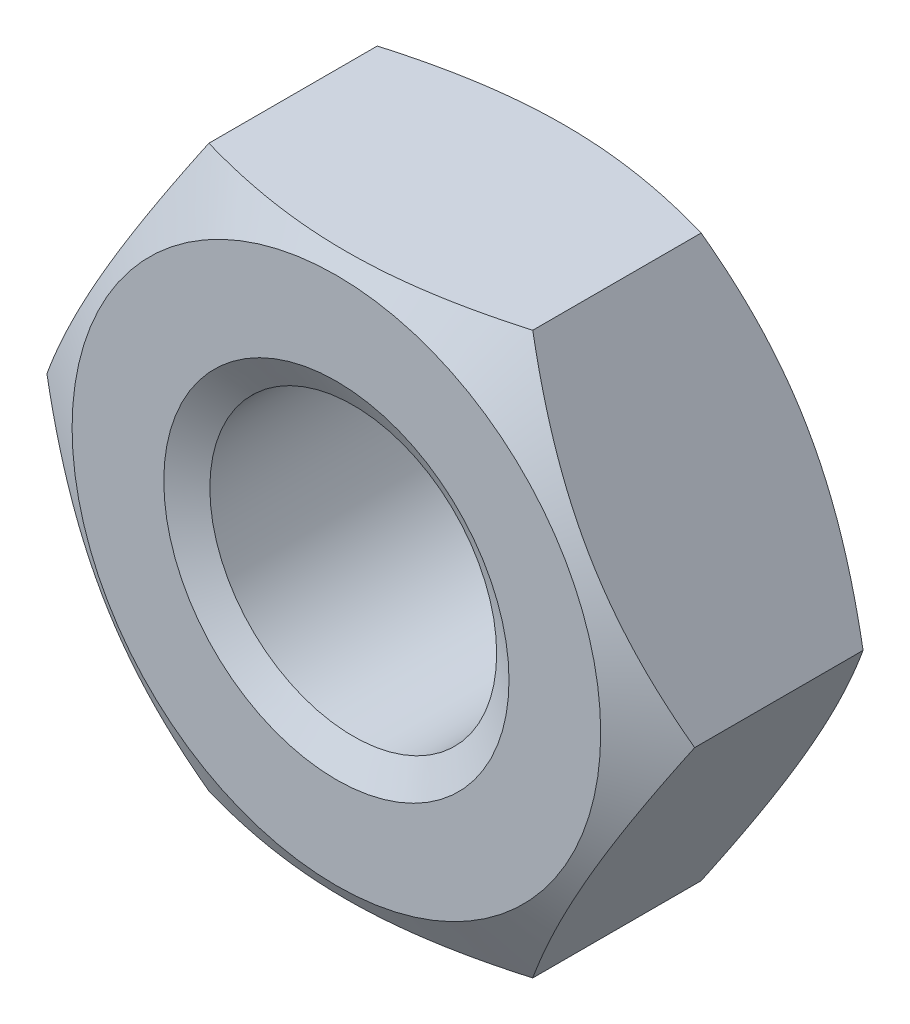
ISO-10303-21;
HEADER;
FILE_DESCRIPTION(('STEP AP214'),'2;1');
FILE_NAME('part.step','',(''),(''),'','','');
FILE_SCHEMA(('AUTOMOTIVE_DESIGN { 1 0 10303 214 1 1 1 1 }'));
ENDSEC;
DATA;
#1=APPLICATION_CONTEXT('core data for automotive mechanical design processes');
#2=APPLICATION_PROTOCOL_DEFINITION('international standard','automotive_design',2000,#1);
#3=PRODUCT_CONTEXT('',#1,'mechanical');
#4=PRODUCT('Part','Part','',(#3));
#5=PRODUCT_RELATED_PRODUCT_CATEGORY('part','',(#4));
#6=PRODUCT_DEFINITION_FORMATION('','',#4);
#7=PRODUCT_DEFINITION_CONTEXT('part definition',#1,'design');
#8=PRODUCT_DEFINITION('design','',#6,#7);
#9=PRODUCT_DEFINITION_SHAPE('','',#8);
#10=(LENGTH_UNIT() NAMED_UNIT(*) SI_UNIT(.MILLI.,.METRE.));
#11=(NAMED_UNIT(*) PLANE_ANGLE_UNIT() SI_UNIT($,.RADIAN.));
#12=(NAMED_UNIT(*) SI_UNIT($,.STERADIAN.) SOLID_ANGLE_UNIT());
#13=UNCERTAINTY_MEASURE_WITH_UNIT(LENGTH_MEASURE(1.E-05),#10,'distance_accuracy_value','');
#14=(GEOMETRIC_REPRESENTATION_CONTEXT(3) GLOBAL_UNCERTAINTY_ASSIGNED_CONTEXT((#13)) GLOBAL_UNIT_ASSIGNED_CONTEXT((#10,
#11,#12)) REPRESENTATION_CONTEXT('',''));
#15=CARTESIAN_POINT('',(0.,0.,0.));
#16=DIRECTION('',(0.,0.,1.));
#17=DIRECTION('',(1.,0.,0.));
#18=AXIS2_PLACEMENT_3D('',#15,#16,#17);
#19=CARTESIAN_POINT('',(0.,-13.,0.));
#20=DIRECTION('',(0.,0.,-1.));
#21=DIRECTION('',(-1.,0.,0.));
#22=AXIS2_PLACEMENT_3D('',#19,#20,#21);
#23=PLANE('',#22);
#24=CARTESIAN_POINT('',(0.,0.,0.));
#25=DIRECTION('',(0.,0.,-1.));
#26=DIRECTION('',(-1.,0.,0.));
#27=AXIS2_PLACEMENT_3D('',#24,#25,#26);
#28=CIRCLE('',#27,6.12499999994043);
#29=CARTESIAN_POINT('',(-6.12499999994043,0.,0.));
#30=VERTEX_POINT('',#29);
#31=EDGE_CURVE('E104',#30,#30,#28,.T.);
#32=ORIENTED_EDGE('',*,*,#31,.F.);
#33=EDGE_LOOP('',(#32));
#34=FACE_BOUND('',#33,.T.);
#35=CARTESIAN_POINT('',(0.,0.,0.));
#36=DIRECTION('',(0.,0.,1.));
#37=DIRECTION('',(1.,0.,0.));
#38=AXIS2_PLACEMENT_3D('',#35,#36,#37);
#39=CIRCLE('',#38,4.0000000000191);
#40=CARTESIAN_POINT('',(4.0000000000191,0.,0.));
#41=VERTEX_POINT('',#40);
#42=EDGE_CURVE('E19',#41,#41,#39,.F.);
#43=ORIENTED_EDGE('',*,*,#42,.T.);
#44=EDGE_LOOP('',(#43));
#45=FACE_BOUND('',#44,.T.);
#46=ADVANCED_FACE('F16',(#34,#45),#23,.F.);
#47=CARTESIAN_POINT('',(0.,0.,0.));
#48=DIRECTION('',(0.,0.,1.));
#49=DIRECTION('',(1.,0.,0.));
#50=AXIS2_PLACEMENT_3D('',#47,#48,#49);
#51=CONICAL_SURFACE('',#50,4.0000000000191,1.04719755120605);
#52=ORIENTED_EDGE('',*,*,#42,.F.);
#53=EDGE_LOOP('',(#52));
#54=FACE_BOUND('',#53,.T.);
#55=CARTESIAN_POINT('',(0.,0.,-0.39057745710678));
#56=DIRECTION('',(0.,0.,1.));
#57=DIRECTION('',(1.,0.,0.));
#58=AXIS2_PLACEMENT_3D('',#55,#56,#57);
#59=CIRCLE('',#58,3.3235);
#60=CARTESIAN_POINT('',(3.3235,0.,-0.39057745710678));
#61=VERTEX_POINT('',#60);
#62=EDGE_CURVE('E79',#61,#61,#59,.F.);
#63=ORIENTED_EDGE('',*,*,#62,.T.);
#64=EDGE_LOOP('',(#63));
#65=FACE_BOUND('',#64,.T.);
#66=ADVANCED_FACE('F151',(#54,#65),#51,.F.);
#67=CARTESIAN_POINT('',(0.,0.,-0.801845312196292));
#68=DIRECTION('',(0.,0.,-1.));
#69=DIRECTION('',(-1.,0.,0.));
#70=AXIS2_PLACEMENT_3D('',#67,#68,#69);
#71=CONICAL_SURFACE('',#70,7.5138368204648,1.04719755119331);
#72=CARTESIAN_POINT('',(7.50555349945997,-1.26746405809184E-11,-0.797062934582183));
#73=CARTESIAN_POINT('',(7.42306413225106,-0.142875775100371,-0.749446864134252));
#74=CARTESIAN_POINT('',(7.34026720584725,-0.286284258341302,-0.703991966642178));
#75=CARTESIAN_POINT('',(7.17400096467622,-0.574265835632288,-0.617999720662978));
#76=CARTESIAN_POINT('',(7.09053137628506,-0.718839403612883,-0.57746449352778));
#77=CARTESIAN_POINT('',(6.83878625276132,-1.15487474811409,-0.464034036214897));
#78=CARTESIAN_POINT('',(6.66951702603889,-1.44805764895502,-0.39951709945342));
#79=CARTESIAN_POINT('',(6.41620872846171,-1.88680049033741,-0.323865199560767));
#80=CARTESIAN_POINT('',(6.33292644226829,-2.03104964139492,-0.302314522006785));
#81=CARTESIAN_POINT('',(6.16598561363625,-2.32019963844327,-0.266178050220192));
#82=CARTESIAN_POINT('',(6.08232710510015,-2.46510042571322,-0.251591640626662));
#83=CARTESIAN_POINT('',(5.91486483881255,-2.75515357927398,-0.229755442526423));
#84=CARTESIAN_POINT('',(5.83106135446542,-2.90030547201451,-0.222497328854949));
#85=CARTESIAN_POINT('',(5.663381658914,-3.19073522410725,-0.215465561854509));
#86=CARTESIAN_POINT('',(5.57950545003741,-3.33601307942777,-0.215691677222158));
#87=CARTESIAN_POINT('',(5.34972638911367,-3.73400208746314,-0.226597904744973));
#88=CARTESIAN_POINT('',(5.20389879784426,-3.98658288468715,-0.244897374835346));
#89=CARTESIAN_POINT('',(4.913212163536,-4.49006690439025,-0.302918893745997));
#90=CARTESIAN_POINT('',(4.7683541423755,-4.74096835692412,-0.34266076347519));
#91=CARTESIAN_POINT('',(4.47708276744821,-5.24546517708864,-0.442001445728198));
#92=CARTESIAN_POINT('',(4.33070615631917,-5.49899690460388,-0.502021047428562));
#93=CARTESIAN_POINT('',(4.04013550251964,-6.00228004017317,-0.638240383200471));
#94=CARTESIAN_POINT('',(3.89593774018915,-6.25203789086733,-0.714408131324337));
#95=CARTESIAN_POINT('',(3.75277674973737,-6.49999999999169,-0.797062934584546));
#96=B_SPLINE_CURVE_WITH_KNOTS('',3,(#72,#73,#74,#75,#76,#77,#78,#79,#80,#81,#82,#83,#84,#85,#86,
#87,#88,#89,#90,#91,#92,#93,#94,#95),.UNSPECIFIED.,.F.,.F.,(4,2,2,2,2,2,2,2,2,2,2,4),(0.,
0.515097151807919,1.03041562924708,2.06319349702549,2.56693469263122,3.07063136955379,
3.57375518587219,4.0768634529426,4.95263085757274,5.82920919384532,6.72522583709603,
7.61948397792585),.UNSPECIFIED.);
#97=CARTESIAN_POINT('',(7.50555349943455,-6.01295083421546E-12,-0.797062934546425));
#98=VERTEX_POINT('',#97);
#99=CARTESIAN_POINT('',(3.75277674973527,-6.49999999999533,-0.797062934585759));
#100=VERTEX_POINT('',#99);
#101=EDGE_CURVE('E70',#98,#100,#96,.T.);
#102=ORIENTED_EDGE('',*,*,#101,.F.);
#103=CARTESIAN_POINT('',(3.75277674974378,6.49999999999553,-0.797062934579687));
#104=CARTESIAN_POINT('',(3.83526611694781,6.35712422490451,-0.74944686413392));
#105=CARTESIAN_POINT('',(3.9180630433495,6.21371574166224,-0.703991966642765));
#106=CARTESIAN_POINT('',(4.08432928451886,5.9257341643704,-0.617999720664248));
#107=CARTESIAN_POINT('',(4.16779887291045,5.78116059639029,-0.577464493528816));
#108=CARTESIAN_POINT('',(4.4195439964348,5.34512525188997,-0.464034036215522));
#109=CARTESIAN_POINT('',(4.58881322315667,5.05194235104894,-0.399517099454174));
#110=CARTESIAN_POINT('',(4.84212152073355,4.61319950966673,-0.323865199561441));
#111=CARTESIAN_POINT('',(4.92540380692696,4.46895035860932,-0.302314522007389));
#112=CARTESIAN_POINT('',(5.09234463555894,4.17980036156114,-0.266178050220664));
#113=CARTESIAN_POINT('',(5.17600314409498,4.03489957429126,-0.251591640627072));
#114=CARTESIAN_POINT('',(5.34346541038249,3.74484642073065,-0.229755442526694));
#115=CARTESIAN_POINT('',(5.42726889472957,3.5996945279902,-0.222497328855143));
#116=CARTESIAN_POINT('',(5.5949485902809,3.30926477589762,-0.215465561854542));
#117=CARTESIAN_POINT('',(5.67882479915745,3.16398692057717,-0.215691677222107));
#118=CARTESIAN_POINT('',(5.90860386008122,2.76599791254175,-0.226597904744688));
#119=CARTESIAN_POINT('',(6.05443145135071,2.5134171153176,-0.244897374834928));
#120=CARTESIAN_POINT('',(6.34511808565913,2.00993309561422,-0.302918893745348));
#121=CARTESIAN_POINT('',(6.48997610681972,1.7590316430802,-0.342660763474445));
#122=CARTESIAN_POINT('',(6.78124748174717,1.2545348229154,-0.442001445727291));
#123=CARTESIAN_POINT('',(6.92762409287628,1.00100309540004,-0.502021047427587));
#124=CARTESIAN_POINT('',(7.21819474667595,0.497719959830505,-0.638240383199387));
#125=CARTESIAN_POINT('',(7.3623925090065,0.247962109136237,-0.714408131323212));
#126=CARTESIAN_POINT('',(7.50555349945834,1.17642045864442E-11,-0.797062934583393));
#127=B_SPLINE_CURVE_WITH_KNOTS('',3,(#103,#104,#105,#106,#107,#108,#109,#110,#111,#112,#113,
#114,#115,#116,#117,#118,#119,#120,#121,#122,#123,#124,#125,#126),.UNSPECIFIED.,.F.,.F.,(4,2,2,
2,2,2,2,2,2,2,2,4),(0.,0.515097151807478,1.03041562924625,2.063193497024,2.56693469262949,
3.07063136955181,3.57375518586995,4.07686345294009,4.95263085757068,5.82920919384372,
6.72522583709482,7.61948397792498),.UNSPECIFIED.);
#128=CARTESIAN_POINT('',(3.75277674972718,6.5,-0.797062934585759));
#129=VERTEX_POINT('',#128);
#130=EDGE_CURVE('E60',#129,#98,#127,.T.);
#131=ORIENTED_EDGE('',*,*,#130,.F.);
#132=CARTESIAN_POINT('',(-3.75277674972309,6.50000000000748,-0.797062934579684));
#133=CARTESIAN_POINT('',(-3.58779801530686,6.50000000000275,-0.749446864133918));
#134=CARTESIAN_POINT('',(-3.42220416250001,6.50000000000075,-0.703991966642763));
#135=CARTESIAN_POINT('',(-3.08967168015869,6.49999999999925,-0.617999720664246));
#136=CARTESIAN_POINT('',(-2.92273250337635,6.49999999999974,-0.577464493528813));
#137=CARTESIAN_POINT('',(-2.41924225632901,6.50000000000052,-0.46403403621552));
#138=CARTESIAN_POINT('',(-2.08070380288452,6.50000000000009,-0.399517099454172));
#139=CARTESIAN_POINT('',(-1.57408720773052,6.49999999999995,-0.32386519956144));
#140=CARTESIAN_POINT('',(-1.40752263534376,6.49999999999999,-0.302314522007387));
#141=CARTESIAN_POINT('',(-1.07364097807985,6.50000000000001,-0.266178050220662));
#142=CARTESIAN_POINT('',(-0.906323961007753,6.5,-0.25159164062707));
#143=CARTESIAN_POINT('',(-0.57139942843272,6.5,-0.229755442526693));
#144=CARTESIAN_POINT('',(-0.403792459738558,6.5,-0.222497328855141));
#145=CARTESIAN_POINT('',(-0.0684330686359017,6.5,-0.21546556185454));
#146=CARTESIAN_POINT('',(0.0993193491171958,6.5,-0.215691677222106));
#147=CARTESIAN_POINT('',(0.558877470965063,6.5,-0.226597904744695));
#148=CARTESIAN_POINT('',(0.850532653504385,6.5,-0.244897374834969));
#149=CARTESIAN_POINT('',(1.4319059221219,6.5,-0.302918893745506));
#150=CARTESIAN_POINT('',(1.7216219644434,6.5,-0.342660763474685));
#151=CARTESIAN_POINT('',(2.30416471429897,6.5,-0.442001445727735));
#152=CARTESIAN_POINT('',(2.59691793655753,6.5,-0.502021047428155));
#153=CARTESIAN_POINT('',(3.17805924415753,6.5,-0.63824038320023));
#154=CARTESIAN_POINT('',(3.46645476881897,6.5,-0.714408131324206));
#155=CARTESIAN_POINT('',(3.75277674972298,6.5,-0.797062934584545));
#156=B_SPLINE_CURVE_WITH_KNOTS('',3,(#132,#133,#134,#135,#136,#137,#138,#139,#140,#141,#142,
#143,#144,#145,#146,#147,#148,#149,#150,#151,#152,#153,#154,#155),.UNSPECIFIED.,.F.,.F.,(4,2,2,
2,2,2,2,2,2,2,2,4),(0.,0.51509715180748,1.03041562924625,2.06319349702401,2.56693469262949,
3.07063136955181,3.57375518586995,4.07686345294009,4.95263085757168,5.82920919384574,
6.72522583709791,7.61948397792913),.UNSPECIFIED.);
#157=CARTESIAN_POINT('',(-3.75277674973526,6.49999999999533,-0.797062934585758));
#158=VERTEX_POINT('',#157);
#159=EDGE_CURVE('E90',#158,#129,#156,.T.);
#160=ORIENTED_EDGE('',*,*,#159,.F.);
#161=CARTESIAN_POINT('',(-7.50555349945997,1.26724419200023E-11,-0.79706293458218));
#162=CARTESIAN_POINT('',(-7.42306413225105,0.142875775100368,-0.74944686413425));
#163=CARTESIAN_POINT('',(-7.34026720584725,0.286284258341299,-0.703991966642177));
#164=CARTESIAN_POINT('',(-7.17400096467621,0.574265835632285,-0.617999720662976));
#165=CARTESIAN_POINT('',(-7.09053137628506,0.71883940361288,-0.577464493527778));
#166=CARTESIAN_POINT('',(-6.83878625276132,1.15487474811409,-0.464034036214895));
#167=CARTESIAN_POINT('',(-6.66951702603889,1.44805764895501,-0.399517099453419));
#168=CARTESIAN_POINT('',(-6.41620872846171,1.8868004903374,-0.323865199560765));
#169=CARTESIAN_POINT('',(-6.33292644226829,2.03104964139492,-0.302314522006782));
#170=CARTESIAN_POINT('',(-6.16598561363625,2.32019963844327,-0.266178050220189));
#171=CARTESIAN_POINT('',(-6.08232710510015,2.46510042571321,-0.25159164062666));
#172=CARTESIAN_POINT('',(-5.91486483881255,2.75515357927397,-0.229755442526421));
#173=CARTESIAN_POINT('',(-5.83106135446542,2.9003054720145,-0.222497328854946));
#174=CARTESIAN_POINT('',(-5.663381658914,3.19073522410724,-0.215465561854506));
#175=CARTESIAN_POINT('',(-5.57950545003741,3.33601307942776,-0.215691677222155));
#176=CARTESIAN_POINT('',(-5.34972638911367,3.73400208746313,-0.22659790474497));
#177=CARTESIAN_POINT('',(-5.20389879784426,3.98658288468715,-0.244897374835343));
#178=CARTESIAN_POINT('',(-4.913212163536,4.49006690439024,-0.302918893745994));
#179=CARTESIAN_POINT('',(-4.7683541423755,4.74096835692412,-0.342660763475187));
#180=CARTESIAN_POINT('',(-4.4770827674482,5.24546517708864,-0.442001445728195));
#181=CARTESIAN_POINT('',(-4.33070615631917,5.49899690460388,-0.50202104742856));
#182=CARTESIAN_POINT('',(-4.04013550251964,6.00228004017318,-0.63824038320047));
#183=CARTESIAN_POINT('',(-3.89593774018914,6.25203789086733,-0.714408131324337));
#184=CARTESIAN_POINT('',(-3.75277674973736,6.4999999999917,-0.797062934584547));
#185=B_SPLINE_CURVE_WITH_KNOTS('',3,(#161,#162,#163,#164,#165,#166,#167,#168,#169,#170,#171,
#172,#173,#174,#175,#176,#177,#178,#179,#180,#181,#182,#183,#184),.UNSPECIFIED.,.F.,.F.,(4,2,2,
2,2,2,2,2,2,2,2,4),(0.,0.515097151807918,1.03041562924708,2.06319349702549,2.56693469263122,
3.07063136955378,3.57375518587219,4.07686345294259,4.95263085757274,5.82920919384532,
6.72522583709604,7.61948397792586),.UNSPECIFIED.);
#186=CARTESIAN_POINT('',(-7.50555349943932,0.,-0.797062934576849));
#187=VERTEX_POINT('',#186);
#188=EDGE_CURVE('E94',#187,#158,#185,.T.);
#189=ORIENTED_EDGE('',*,*,#188,.F.);
#190=CARTESIAN_POINT('',(-3.75277674974378,-6.49999999999553,-0.797062934579687));
#191=CARTESIAN_POINT('',(-3.83526611694781,-6.35712422490451,-0.74944686413392));
#192=CARTESIAN_POINT('',(-3.9180630433495,-6.21371574166224,-0.703991966642765));
#193=CARTESIAN_POINT('',(-4.08432928451886,-5.9257341643704,-0.617999720664248));
#194=CARTESIAN_POINT('',(-4.16779887291045,-5.78116059639028,-0.577464493528815));
#195=CARTESIAN_POINT('',(-4.4195439964348,-5.34512525188997,-0.464034036215522));
#196=CARTESIAN_POINT('',(-4.58881322315667,-5.05194235104894,-0.399517099454173));
#197=CARTESIAN_POINT('',(-4.84212152073355,-4.61319950966673,-0.323865199561441));
#198=CARTESIAN_POINT('',(-4.92540380692696,-4.46895035860932,-0.302314522007389));
#199=CARTESIAN_POINT('',(-5.09234463555893,-4.17980036156114,-0.266178050220664));
#200=CARTESIAN_POINT('',(-5.17600314409498,-4.03489957429126,-0.251591640627072));
#201=CARTESIAN_POINT('',(-5.34346541038249,-3.74484642073065,-0.229755442526694));
#202=CARTESIAN_POINT('',(-5.42726889472957,-3.5996945279902,-0.222497328855143));
#203=CARTESIAN_POINT('',(-5.5949485902809,-3.30926477589762,-0.215465561854542));
#204=CARTESIAN_POINT('',(-5.67882479915745,-3.16398692057717,-0.215691677222107));
#205=CARTESIAN_POINT('',(-5.90860386008122,-2.76599791254175,-0.226597904744688));
#206=CARTESIAN_POINT('',(-6.05443145135071,-2.5134171153176,-0.244897374834928));
#207=CARTESIAN_POINT('',(-6.34511808565913,-2.00993309561422,-0.302918893745348));
#208=CARTESIAN_POINT('',(-6.48997610681972,-1.7590316430802,-0.342660763474445));
#209=CARTESIAN_POINT('',(-6.78124748174717,-1.25453482291541,-0.44200144572729));
#210=CARTESIAN_POINT('',(-6.92762409287628,-1.00100309540004,-0.502021047427587));
#211=CARTESIAN_POINT('',(-7.21819474667594,-0.497719959830508,-0.638240383199386));
#212=CARTESIAN_POINT('',(-7.3623925090065,-0.247962109136239,-0.714408131323212));
#213=CARTESIAN_POINT('',(-7.50555349945834,-1.17669440239003E-11,-0.797062934583392));
#214=B_SPLINE_CURVE_WITH_KNOTS('',3,(#190,#191,#192,#193,#194,#195,#196,#197,#198,#199,#200,
#201,#202,#203,#204,#205,#206,#207,#208,#209,#210,#211,#212,#213),.UNSPECIFIED.,.F.,.F.,(4,2,2,
2,2,2,2,2,2,2,2,4),(0.,0.515097151807478,1.03041562924625,2.063193497024,2.56693469262948,
3.07063136955181,3.57375518586995,4.07686345294009,4.95263085757067,5.82920919384372,
6.72522583709482,7.61948397792498),.UNSPECIFIED.);
#215=CARTESIAN_POINT('',(-3.75277674972718,-6.5,-0.797062934585759));
#216=VERTEX_POINT('',#215);
#217=EDGE_CURVE('E98',#216,#187,#214,.T.);
#218=ORIENTED_EDGE('',*,*,#217,.F.);
#219=CARTESIAN_POINT('',(3.7527767497231,-6.50000000000747,-0.797062934579686));
#220=CARTESIAN_POINT('',(3.58779801530687,-6.50000000000275,-0.74944686413392));
#221=CARTESIAN_POINT('',(3.42220416250002,-6.50000000000075,-0.703991966642764));
#222=CARTESIAN_POINT('',(3.0896716801587,-6.49999999999925,-0.617999720664247));
#223=CARTESIAN_POINT('',(2.92273250337636,-6.49999999999974,-0.577464493528814));
#224=CARTESIAN_POINT('',(2.41924225632902,-6.50000000000052,-0.46403403621552));
#225=CARTESIAN_POINT('',(2.08070380288453,-6.50000000000009,-0.399517099454173));
#226=CARTESIAN_POINT('',(1.57408720773053,-6.49999999999995,-0.32386519956144));
#227=CARTESIAN_POINT('',(1.40752263534377,-6.49999999999999,-0.302314522007387));
#228=CARTESIAN_POINT('',(1.07364097807986,-6.50000000000001,-0.266178050220662));
#229=CARTESIAN_POINT('',(0.90632396100776,-6.5,-0.25159164062707));
#230=CARTESIAN_POINT('',(0.571399428432728,-6.5,-0.229755442526693));
#231=CARTESIAN_POINT('',(0.403792459738565,-6.5,-0.222497328855142));
#232=CARTESIAN_POINT('',(0.0684330686359089,-6.5,-0.21546556185454));
#233=CARTESIAN_POINT('',(-0.0993193491171888,-6.5,-0.215691677222105));
#234=CARTESIAN_POINT('',(-0.558877470965056,-6.5,-0.226597904744694));
#235=CARTESIAN_POINT('',(-0.850532653504379,-6.5,-0.244897374834968));
#236=CARTESIAN_POINT('',(-1.43190592212189,-6.5,-0.302918893745506));
#237=CARTESIAN_POINT('',(-1.72162196444339,-6.5,-0.342660763474684));
#238=CARTESIAN_POINT('',(-2.30416471429897,-6.5,-0.442001445727734));
#239=CARTESIAN_POINT('',(-2.59691793655752,-6.5,-0.502021047428154));
#240=CARTESIAN_POINT('',(-3.17805924415753,-6.5,-0.638240383200229));
#241=CARTESIAN_POINT('',(-3.46645476881897,-6.5,-0.714408131324205));
#242=CARTESIAN_POINT('',(-3.75277674972298,-6.5,-0.797062934584545));
#243=B_SPLINE_CURVE_WITH_KNOTS('',3,(#219,#220,#221,#222,#223,#224,#225,#226,#227,#228,#229,
#230,#231,#232,#233,#234,#235,#236,#237,#238,#239,#240,#241,#242),.UNSPECIFIED.,.F.,.F.,(4,2,2,
2,2,2,2,2,2,2,2,4),(0.,0.515097151807481,1.03041562924625,2.06319349702401,2.56693469262949,
3.07063136955181,3.57375518586995,4.07686345294009,4.95263085757169,5.82920919384575,
6.72522583709792,7.61948397792914),.UNSPECIFIED.);
#244=EDGE_CURVE('E74',#100,#216,#243,.T.);
#245=ORIENTED_EDGE('',*,*,#244,.F.);
#246=EDGE_LOOP('',(#102,#131,#160,#189,#218,#245));
#247=FACE_BOUND('',#246,.T.);
#248=ORIENTED_EDGE('',*,*,#31,.T.);
#249=EDGE_LOOP('',(#248));
#250=FACE_BOUND('',#249,.T.);
#251=ADVANCED_FACE('F71',(#247,#250),#71,.T.);
#252=CARTESIAN_POINT('',(0.,0.,-6.8));
#253=DIRECTION('',(0.,0.,1.));
#254=DIRECTION('',(1.,0.,0.));
#255=AXIS2_PLACEMENT_3D('',#252,#253,#254);
#256=CYLINDRICAL_SURFACE('',#255,3.3235);
#257=CARTESIAN_POINT('',(0.,0.,-5.09999999997035));
#258=DIRECTION('',(0.,0.,-1.));
#259=DIRECTION('',(-1.,0.,0.));
#260=AXIS2_PLACEMENT_3D('',#257,#258,#259);
#261=CIRCLE('',#260,3.3235000000218);
#262=CARTESIAN_POINT('',(-3.3235000000218,0.,-5.09999999997035));
#263=VERTEX_POINT('',#262);
#264=EDGE_CURVE('E84',#263,#263,#261,.T.);
#265=ORIENTED_EDGE('',*,*,#264,.T.);
#266=EDGE_LOOP('',(#265));
#267=FACE_BOUND('',#266,.T.);
#268=ORIENTED_EDGE('',*,*,#62,.F.);
#269=EDGE_LOOP('',(#268));
#270=FACE_BOUND('',#269,.T.);
#271=ADVANCED_FACE('F150',(#267,#270),#256,.F.);
#272=CARTESIAN_POINT('',(3.75277674973258,-6.5,-6.8));
#273=DIRECTION('',(0.866025403784439,-0.5,0.));
#274=DIRECTION('',(0.5,0.866025403784439,0.));
#275=AXIS2_PLACEMENT_3D('',#272,#273,#274);
#276=PLANE('',#275);
#277=ORIENTED_EDGE('',*,*,#101,.T.);
#278=DIRECTION('',(0.,0.,1.));
#279=VECTOR('',#278,1.);
#280=CARTESIAN_POINT('',(3.75277674973258,-6.5,-6.8));
#281=LINE('',#280,#279);
#282=CARTESIAN_POINT('',(3.75277677137748,-6.49999996250993,-4.70000001243648));
#283=VERTEX_POINT('',#282);
#284=EDGE_CURVE('E78',#283,#100,#281,.T.);
#285=ORIENTED_EDGE('',*,*,#284,.F.);
#286=CARTESIAN_POINT('',(7.50555349943961,-4.59927503235988E-11,-4.69999999990956));
#287=CARTESIAN_POINT('',(7.42303699090516,-0.142922785289727,-4.74780718963419));
#288=CARTESIAN_POINT('',(7.34021064037411,-0.286382232614545,-4.7934451338097));
#289=CARTESIAN_POINT('',(7.17388030748702,-0.574474820014469,-4.87978381108413));
#290=CARTESIAN_POINT('',(7.0903760468018,-0.719108442169872,-4.92048239416971));
#291=CARTESIAN_POINT('',(6.83851575107887,-1.1553432707715,-5.03436935455443));
#292=CARTESIAN_POINT('',(6.66915808624861,-1.44867935090862,-5.09914319894474));
#293=CARTESIAN_POINT('',(6.41572193059373,-1.88764364897778,-5.1750751216362));
#294=CARTESIAN_POINT('',(6.33240638004381,-2.03195041559082,-5.19670009757581));
#295=CARTESIAN_POINT('',(6.16539624694976,-2.32122045148856,-5.23295346143799));
#296=CARTESIAN_POINT('',(6.08170169885143,-2.46618366111138,-5.24758247280886));
#297=CARTESIAN_POINT('',(5.91416672131715,-2.75636275424566,-5.26946983898017));
#298=CARTESIAN_POINT('',(5.8303265696832,-2.90157815658994,-5.27673663664082));
#299=CARTESIAN_POINT('',(5.66257345475982,-3.19213507476518,-5.28375134433767));
#300=CARTESIAN_POINT('',(5.57866049382923,-3.3374765865105,-5.28349948948667));
#301=CARTESIAN_POINT('',(5.34891260639935,-3.73541160047067,-5.27248255514731));
#302=CARTESIAN_POINT('',(5.20315399770455,-3.98787291637062,-5.25408410996374));
#303=CARTESIAN_POINT('',(4.91261238717601,-4.49110574751894,-5.19581136800484));
#304=CARTESIAN_POINT('',(4.76783042287445,-4.74187546570887,-5.15591704323436));
#305=CARTESIAN_POINT('',(4.47670158312332,-5.24612540770639,-5.0562190888417));
#306=CARTESIAN_POINT('',(4.330391935388,-5.49954115122147,-4.99599085196764));
#307=CARTESIAN_POINT('',(4.03996879204939,-6.0025687911778,-4.85931971681482));
#308=CARTESIAN_POINT('',(3.89585152461738,-6.25218722061804,-4.78290912956535));
#309=CARTESIAN_POINT('',(3.75277679302145,-6.49999992502148,-4.70000002497868));
#310=B_SPLINE_CURVE_WITH_KNOTS('',3,(#286,#287,#288,#289,#290,#291,#292,#293,#294,#295,#296,
#297,#298,#299,#300,#301,#302,#303,#304,#305,#306,#307,#308,#309),.UNSPECIFIED.,.F.,.F.,(4,2,2,
2,2,2,2,2,2,2,2,4),(0.,0.515412518945595,1.03104858893057,2.06448237103259,2.56844910772266,
3.07237092483326,3.57571419669567,4.07904172872666,4.9544095024563,5.83059428178326,
6.7263406391918,7.62031505857119),.UNSPECIFIED.);
#311=CARTESIAN_POINT('',(7.5055534994096,0.,-4.69999999996168));
#312=VERTEX_POINT('',#311);
#313=EDGE_CURVE('E83',#312,#283,#310,.T.);
#314=ORIENTED_EDGE('',*,*,#313,.F.);
#315=DIRECTION('',(0.,0.,1.));
#316=VECTOR('',#315,1.);
#317=CARTESIAN_POINT('',(7.50555349946514,0.,-6.8));
#318=LINE('',#317,#316);
#319=EDGE_CURVE('E34',#98,#312,#318,.F.);
#320=ORIENTED_EDGE('',*,*,#319,.F.);
#321=EDGE_LOOP('',(#277,#285,#314,#320));
#322=FACE_BOUND('',#321,.T.);
#323=ADVANCED_FACE('F82',(#322),#276,.T.);
#324=CARTESIAN_POINT('',(-3.75277674973256,-6.5,-6.8));
#325=DIRECTION('',(0.,-1.,0.));
#326=DIRECTION('',(1.,0.,0.));
#327=AXIS2_PLACEMENT_3D('',#324,#325,#326);
#328=PLANE('',#327);
#329=ORIENTED_EDGE('',*,*,#244,.T.);
#330=DIRECTION('',(0.,0.,1.));
#331=VECTOR('',#330,1.);
#332=CARTESIAN_POINT('',(-3.75277674973257,-6.5,-6.8));
#333=LINE('',#332,#331);
#334=CARTESIAN_POINT('',(-3.75277670644439,-6.5,-4.70000001243601));
#335=VERTEX_POINT('',#334);
#336=EDGE_CURVE('E99',#335,#216,#333,.T.);
#337=ORIENTED_EDGE('',*,*,#336,.F.);
#338=CARTESIAN_POINT('',(3.75277677636153,-6.49999996253879,-4.69999996768154));
#339=CARTESIAN_POINT('',(3.58774376180418,-6.49999998621388,-4.74780717247496));
#340=CARTESIAN_POINT('',(3.42209106096878,-6.49999999622857,-4.79344512342462));
#341=CARTESIAN_POINT('',(3.0894303936541,-6.50000000377306,-4.87978380660095));
#342=CARTESIAN_POINT('',(2.92242187051639,-6.50000000129746,-4.92048238881426));
#343=CARTESIAN_POINT('',(2.41870127454236,-6.49999999739963,-5.03436934857476));
#344=CARTESIAN_POINT('',(2.07998594267824,-6.49999999953161,-5.09914319528522));
#345=CARTESIAN_POINT('',(1.57311362780811,-6.50000000022842,-5.1750751196359));
#346=CARTESIAN_POINT('',(1.40648252559796,-6.5000000000612,-5.19670009582551));
#347=CARTESIAN_POINT('',(1.07246225723202,-6.4999999999388,-5.23295346023176));
#348=CARTESIAN_POINT('',(0.905073159967937,-6.49999999998359,-5.24758247189773));
#349=CARTESIAN_POINT('',(0.570003202688611,-6.50000000001639,-5.26946983853795));
#350=CARTESIAN_POINT('',(0.402322898277242,-6.50000000000447,-5.27673663637015));
#351=CARTESIAN_POINT('',(0.0668166661282161,-6.49999999999553,-5.28375134431755));
#352=CARTESIAN_POINT('',(-0.101009256891759,-6.49999999999851,-5.28349948954504));
#353=CARTESIAN_POINT('',(-0.56050503309441,-6.5000000000026,-5.27248255531847));
#354=CARTESIAN_POINT('',(-0.852022250671479,-6.5000000000007,-5.25408411020438));
#355=CARTESIAN_POINT('',(-1.43310547204756,-6.4999999999993,-5.19581136835763));
#356=CARTESIAN_POINT('',(-1.72266940078265,-6.4999999999998,-5.15591704363408));
#357=CARTESIAN_POINT('',(-2.3049270808084,-6.50000000000021,-5.05621908926672));
#358=CARTESIAN_POINT('',(-2.59754637666756,-6.5000000000001,-4.99599085235329));
#359=CARTESIAN_POINT('',(-3.17839266419266,-6.4999999999999,-4.85931971705513));
#360=CARTESIAN_POINT('',(-3.46662719951503,-6.49999999999979,-4.78290912969524));
#361=CARTESIAN_POINT('',(-3.75277666315791,-6.5,-4.70000002497779));
#362=B_SPLINE_CURVE_WITH_KNOTS('',3,(#338,#339,#340,#341,#342,#343,#344,#345,#346,#347,#348,
#349,#350,#351,#352,#353,#354,#355,#356,#357,#358,#359,#360,#361),.UNSPECIFIED.,.F.,.F.,(4,2,2,
2,2,2,2,2,2,2,2,4),(0.,0.515412523676989,1.03104859805641,2.0644823882594,2.56844912830344,
3.0723709486937,3.5757142239973,4.07904175950238,4.95440953377745,5.83059431347618,
6.72634067204767,7.62031509283759),.UNSPECIFIED.);
#363=EDGE_CURVE('E183',#283,#335,#362,.T.);
#364=ORIENTED_EDGE('',*,*,#363,.F.);
#365=ORIENTED_EDGE('',*,*,#284,.T.);
#366=EDGE_LOOP('',(#329,#337,#364,#365));
#367=FACE_BOUND('',#366,.T.);
#368=ADVANCED_FACE('F175',(#367),#328,.T.);
#369=CARTESIAN_POINT('',(-7.50555349946514,0.,-6.8));
#370=DIRECTION('',(-0.866025403784439,-0.5,0.));
#371=DIRECTION('',(0.5,-0.866025403784439,0.));
#372=AXIS2_PLACEMENT_3D('',#369,#370,#371);
#373=PLANE('',#372);
#374=ORIENTED_EDGE('',*,*,#217,.T.);
#375=DIRECTION('',(0.,0.,1.));
#376=VECTOR('',#375,1.);
#377=CARTESIAN_POINT('',(-7.50555349946514,0.,-6.8));
#378=LINE('',#377,#376);
#379=CARTESIAN_POINT('',(-7.50555349942641,0.,-4.69999999995707));
#380=VERTEX_POINT('',#379);
#381=EDGE_CURVE('E95',#380,#187,#378,.T.);
#382=ORIENTED_EDGE('',*,*,#381,.F.);
#383=CARTESIAN_POINT('',(-3.75277670397815,-6.5000000043286,-4.69999996768309));
#384=CARTESIAN_POINT('',(-3.83529323176657,-6.35707723308378,-4.74780717248016));
#385=CARTESIAN_POINT('',(-3.91811959086411,-6.21361779094972,-4.79344512343332));
#386=CARTESIAN_POINT('',(-4.08444993106929,-5.92552520596272,-4.87978380661597));
#387=CARTESIAN_POINT('',(-4.16795419050146,-5.78089158102671,-4.9204823888321));
#388=CARTESIAN_POINT('',(-4.41981448513655,-5.34465674651404,-5.03436934860022));
#389=CARTESIAN_POINT('',(-4.58917215293151,-5.05132066550562,-5.09914319531358));
#390=CARTESIAN_POINT('',(-4.84260831097949,-4.61235636468505,-5.1750751196594));
#391=CARTESIAN_POINT('',(-4.92592386193245,-4.4680495970395,-5.19670009584481));
#392=CARTESIAN_POINT('',(-5.0929339959947,-4.17877955922,-5.23295346024381));
#393=CARTESIAN_POINT('',(-5.17662854465812,-4.03381634870798,-5.24758247190674));
#394=CARTESIAN_POINT('',(-5.3441635233105,-3.7436372537027,-5.2694698385419));
#395=CARTESIAN_POINT('',(-5.42800367549758,-3.59842185037654,-5.27673663637216));
#396=CARTESIAN_POINT('',(-5.59575679154784,-3.30786493023159,-5.28375134431765));
#397=CARTESIAN_POINT('',(-5.67966975305219,-3.16252341749845,-5.28349948954516));
#398=CARTESIAN_POINT('',(-5.90941764480213,-2.76458839606389,-5.27248255514233));
#399=CARTESIAN_POINT('',(-6.05517625723745,-2.51212707368138,-5.25408410927836));
#400=CARTESIAN_POINT('',(-6.34571787515919,-2.00889422972486,-5.19581136490171));
#401=CARTESIAN_POINT('',(-6.4904998431135,-1.75812450520919,-5.15591703839568));
#402=CARTESIAN_POINT('',(-6.78162869038322,-1.2538745501899,-5.05621907958446));
#403=CARTESIAN_POINT('',(-6.92793834197926,-1.00045879998765,-4.99599083997729));
#404=CARTESIAN_POINT('',(-7.21836149294048,-0.497431146828147,-4.85931969870662));
#405=CARTESIAN_POINT('',(-7.36247876413436,-0.247812710871959,-4.78290910807156));
#406=CARTESIAN_POINT('',(-7.50555349943884,-4.55567710809223E-11,-4.69999999990898));
#407=B_SPLINE_CURVE_WITH_KNOTS('',3,(#383,#384,#385,#386,#387,#388,#389,#390,#391,#392,#393,
#394,#395,#396,#397,#398,#399,#400,#401,#402,#403,#404,#405,#406),.UNSPECIFIED.,.F.,.F.,(4,2,2,
2,2,2,2,2,2,2,2,4),(0.,0.51541252372083,1.03104859814418,2.06448238844628,2.56844912844525,
3.07237094879053,3.57571422404399,4.07904175950088,4.95440955569391,5.83059435739228,
6.72634073911342,7.62031518287544),.UNSPECIFIED.);
#408=EDGE_CURVE('E189',#335,#380,#407,.T.);
#409=ORIENTED_EDGE('',*,*,#408,.F.);
#410=ORIENTED_EDGE('',*,*,#336,.T.);
#411=EDGE_LOOP('',(#374,#382,#409,#410));
#412=FACE_BOUND('',#411,.T.);
#413=ADVANCED_FACE('F179',(#412),#373,.T.);
#414=CARTESIAN_POINT('',(-3.75277674973257,6.5,-6.8));
#415=DIRECTION('',(-0.866025403784439,0.5,0.));
#416=DIRECTION('',(-0.5,-0.866025403784439,0.));
#417=AXIS2_PLACEMENT_3D('',#414,#415,#416);
#418=PLANE('',#417);
#419=ORIENTED_EDGE('',*,*,#188,.T.);
#420=DIRECTION('',(0.,0.,1.));
#421=VECTOR('',#420,1.);
#422=CARTESIAN_POINT('',(-3.75277674973257,6.5,-6.8));
#423=LINE('',#422,#421);
#424=CARTESIAN_POINT('',(-3.75277677136604,6.49999996252973,-4.70000001242986));
#425=VERTEX_POINT('',#424);
#426=EDGE_CURVE('E91',#425,#158,#423,.T.);
#427=ORIENTED_EDGE('',*,*,#426,.F.);
#428=CARTESIAN_POINT('',(-7.50555349943961,4.5991713707232E-11,-4.69999999990956));
#429=CARTESIAN_POINT('',(-7.42303699090516,0.142922785289732,-4.74780718963419));
#430=CARTESIAN_POINT('',(-7.3402106403741,0.286382232614555,-4.79344513380971));
#431=CARTESIAN_POINT('',(-7.173880307487,0.574474820014493,-4.87978381108414));
#432=CARTESIAN_POINT('',(-7.09037604680178,0.719108442169902,-4.92048239416972));
#433=CARTESIAN_POINT('',(-6.83851575107883,1.15534327077155,-5.03436935455445));
#434=CARTESIAN_POINT('',(-6.66915808624857,1.44867935090868,-5.09914319894475));
#435=CARTESIAN_POINT('',(-6.41572193059368,1.88764364897785,-5.17507512163621));
#436=CARTESIAN_POINT('',(-6.33240638004376,2.03195041559089,-5.19670009757582));
#437=CARTESIAN_POINT('',(-6.16539624694972,2.32122045148861,-5.232953461438));
#438=CARTESIAN_POINT('',(-6.0817016988514,2.46618366111143,-5.24758247280887));
#439=CARTESIAN_POINT('',(-5.91416672131713,2.75636275424569,-5.26946983898017));
#440=CARTESIAN_POINT('',(-5.83032656968319,2.90157815658996,-5.27673663664082));
#441=CARTESIAN_POINT('',(-5.66257345475981,3.19213507476519,-5.28375134433767));
#442=CARTESIAN_POINT('',(-5.57866049382922,3.33747658651051,-5.28349948948667));
#443=CARTESIAN_POINT('',(-5.34891260639749,3.73541160047388,-5.27248255514722));
#444=CARTESIAN_POINT('',(-5.20315399770084,3.98787291637702,-5.25408410996328));
#445=CARTESIAN_POINT('',(-4.91261238716863,4.4911057475317,-5.19581136800309));
#446=CARTESIAN_POINT('',(-4.76783042286525,4.74187546572478,-5.15591704323171));
#447=CARTESIAN_POINT('',(-4.47670158311045,5.24612540772867,-5.05621908883679));
#448=CARTESIAN_POINT('',(-4.33039193537327,5.49954115124697,-4.99599085196137));
#449=CARTESIAN_POINT('',(-4.03996879203102,6.00256879120962,-4.85931971680552));
#450=CARTESIAN_POINT('',(-3.89585152459721,6.25218722065296,-4.78290912955439));
#451=CARTESIAN_POINT('',(-3.75277679299951,6.49999992505946,-4.70000002496597));
#452=B_SPLINE_CURVE_WITH_KNOTS('',3,(#428,#429,#430,#431,#432,#433,#434,#435,#436,#437,#438,
#439,#440,#441,#442,#443,#444,#445,#446,#447,#448,#449,#450,#451),.UNSPECIFIED.,.F.,.F.,(4,2,2,
2,2,2,2,2,2,2,2,4),(0.,0.515412518945617,1.03104858893061,2.06448237103269,2.56844910772273,
3.07237092483331,3.57571419669569,4.07904172872666,4.9544095024674,5.83059428180552,
6.7263406392258,7.62031505861683),.UNSPECIFIED.);
#453=EDGE_CURVE('E194',#380,#425,#452,.T.);
#454=ORIENTED_EDGE('',*,*,#453,.F.);
#455=ORIENTED_EDGE('',*,*,#381,.T.);
#456=EDGE_LOOP('',(#419,#427,#454,#455));
#457=FACE_BOUND('',#456,.T.);
#458=ADVANCED_FACE('F199',(#457),#418,.T.);
#459=CARTESIAN_POINT('',(3.75277674973256,6.5,-6.8));
#460=DIRECTION('',(0.,1.,0.));
#461=DIRECTION('',(0.,0.,1.));
#462=AXIS2_PLACEMENT_3D('',#459,#460,#461);
#463=PLANE('',#462);
#464=ORIENTED_EDGE('',*,*,#159,.T.);
#465=DIRECTION('',(0.,0.,1.));
#466=VECTOR('',#465,1.);
#467=CARTESIAN_POINT('',(3.75277674973257,6.5,-6.8));
#468=LINE('',#467,#466);
#469=CARTESIAN_POINT('',(3.75277670644471,6.5,-4.70000001243592));
#470=VERTEX_POINT('',#469);
#471=EDGE_CURVE('E64',#470,#129,#468,.T.);
#472=ORIENTED_EDGE('',*,*,#471,.F.);
#473=CARTESIAN_POINT('',(-3.75277677637426,6.49999996256364,-4.69999996769411));
#474=CARTESIAN_POINT('',(-3.587743761815,6.49999998622303,-4.74780717247789));
#475=CARTESIAN_POINT('',(-3.42209106097919,6.49999999623107,-4.79344512342343));
#476=CARTESIAN_POINT('',(-3.08943039366503,6.50000000377056,-4.87978380659661));
#477=CARTESIAN_POINT('',(-2.92242187052823,6.5000000012966,-4.92048238881088));
#478=CARTESIAN_POINT('',(-2.4187012745564,6.49999999740136,-5.03436934857299));
#479=CARTESIAN_POINT('',(-2.07998594269318,6.49999999953192,-5.09914319528274));
#480=CARTESIAN_POINT('',(-1.57311362782457,6.50000000022826,-5.17507511963355));
#481=CARTESIAN_POINT('',(-1.40648252561489,6.50000000006116,-5.1967000958234));
#482=CARTESIAN_POINT('',(-1.07246225724984,6.49999999993884,-5.2329534602301));
#483=CARTESIAN_POINT('',(-0.905073159986179,6.4999999999836,-5.24758247189627));
#484=CARTESIAN_POINT('',(-0.570003202707735,6.50000000001638,-5.26946983853697));
#485=CARTESIAN_POINT('',(-0.402322898296824,6.50000000000447,-5.27673663636944));
#486=CARTESIAN_POINT('',(-0.0668166661487098,6.49999999999553,-5.28375134431742));
#487=CARTESIAN_POINT('',(0.101009256870814,6.49999999999851,-5.28349948954523));
#488=CARTESIAN_POINT('',(0.560505033074886,6.5000000000026,-5.27248255531949));
#489=CARTESIAN_POINT('',(0.852022250653839,6.5000000000007,-5.25408411020576));
#490=CARTESIAN_POINT('',(1.43310547203373,6.4999999999993,-5.19581136835941));
#491=CARTESIAN_POINT('',(1.72266940077075,6.4999999999998,-5.1559170436359));
#492=CARTESIAN_POINT('',(2.30492708080025,6.50000000000021,-5.05621908926834));
#493=CARTESIAN_POINT('',(2.59754637666123,6.5000000000001,-4.99599085235469));
#494=CARTESIAN_POINT('',(3.17839266418988,6.4999999999999,-4.85931971705587));
#495=CARTESIAN_POINT('',(3.46662719951396,6.49999999999979,-4.78290912969557));
#496=CARTESIAN_POINT('',(3.75277666315853,6.5,-4.70000002497761));
#497=B_SPLINE_CURVE_WITH_KNOTS('',3,(#473,#474,#475,#476,#477,#478,#479,#480,#481,#482,#483,
#484,#485,#486,#487,#488,#489,#490,#491,#492,#493,#494,#495,#496),.UNSPECIFIED.,.F.,.F.,(4,2,2,
2,2,2,2,2,2,2,2,4),(0.,0.515412523674876,1.03104859805241,2.06448238825213,2.56844912829491,
3.07237094868395,3.57571422398621,4.07904175948993,4.95440953377056,5.83059431347498,
6.72634067205196,7.62031509284717),.UNSPECIFIED.);
#498=EDGE_CURVE('E115',#425,#470,#497,.T.);
#499=ORIENTED_EDGE('',*,*,#498,.F.);
#500=ORIENTED_EDGE('',*,*,#426,.T.);
#501=EDGE_LOOP('',(#464,#472,#499,#500));
#502=FACE_BOUND('',#501,.T.);
#503=ADVANCED_FACE('F128',(#502),#463,.T.);
#504=CARTESIAN_POINT('',(7.50555349946514,0.,-6.8));
#505=DIRECTION('',(0.866025403784439,0.5,0.));
#506=DIRECTION('',(-0.5,0.866025403784439,0.));
#507=AXIS2_PLACEMENT_3D('',#504,#505,#506);
#508=PLANE('',#507);
#509=ORIENTED_EDGE('',*,*,#130,.T.);
#510=ORIENTED_EDGE('',*,*,#319,.T.);
#511=CARTESIAN_POINT('',(3.75277670397863,6.50000000432817,-4.69999996768341));
#512=CARTESIAN_POINT('',(3.83529323176695,6.35707723308328,-4.74780717248038));
#513=CARTESIAN_POINT('',(3.91811959086444,6.2136177909492,-4.7934451234335));
#514=CARTESIAN_POINT('',(4.08444993106958,5.92552520596219,-4.87978380661611));
#515=CARTESIAN_POINT('',(4.16795419050175,5.7808915810262,-4.92048238883223));
#516=CARTESIAN_POINT('',(4.41981448513684,5.34465674651356,-5.03436934860034));
#517=CARTESIAN_POINT('',(4.58917215293178,5.05132066550516,-5.09914319531367));
#518=CARTESIAN_POINT('',(4.84260831097973,4.61235636468462,-5.17507511965947));
#519=CARTESIAN_POINT('',(4.9259238619327,4.46804959703908,-5.19670009584487));
#520=CARTESIAN_POINT('',(5.09293399599494,4.17877955921959,-5.23295346024386));
#521=CARTESIAN_POINT('',(5.17662854465835,4.03381634870759,-5.24758247190677));
#522=CARTESIAN_POINT('',(5.34416352331072,3.74363725370232,-5.26946983854192));
#523=CARTESIAN_POINT('',(5.42800367549779,3.59842185037616,-5.27673663637217));
#524=CARTESIAN_POINT('',(5.59575679154805,3.30786493023124,-5.28375134431765));
#525=CARTESIAN_POINT('',(5.67966975305239,3.1625234174981,-5.28349948954516));
#526=CARTESIAN_POINT('',(5.90941764480231,2.76458839606359,-5.27248255514231));
#527=CARTESIAN_POINT('',(6.05517625723761,2.5121270736811,-5.25408410927833));
#528=CARTESIAN_POINT('',(6.34571787515932,2.00889422972464,-5.19581136490168));
#529=CARTESIAN_POINT('',(6.49049984311362,1.75812450520899,-5.15591703839565));
#530=CARTESIAN_POINT('',(6.7816286903833,1.25387455018975,-5.05621907958443));
#531=CARTESIAN_POINT('',(6.92793834197932,1.00045879998753,-4.99599083997726));
#532=CARTESIAN_POINT('',(7.21836149294052,0.497431146828091,-4.85931969870661));
#533=CARTESIAN_POINT('',(7.36247876413438,0.247812710871931,-4.78290910807156));
#534=CARTESIAN_POINT('',(7.50555349943884,4.55568672325906E-11,-4.69999999990898));
#535=B_SPLINE_CURVE_WITH_KNOTS('',3,(#511,#512,#513,#514,#515,#516,#517,#518,#519,#520,#521,
#522,#523,#524,#525,#526,#527,#528,#529,#530,#531,#532,#533,#534),.UNSPECIFIED.,.F.,.F.,(4,2,2,
2,2,2,2,2,2,2,2,4),(0.,0.515412523720787,1.0310485981441,2.06448238844612,2.56844912844506,
3.07237094879031,3.57571422404373,4.07904175950059,4.95440955569353,5.8305943573918,
6.72634073911285,7.62031518287477),.UNSPECIFIED.);
#536=EDGE_CURVE('E108',#470,#312,#535,.T.);
#537=ORIENTED_EDGE('',*,*,#536,.F.);
#538=ORIENTED_EDGE('',*,*,#471,.T.);
#539=EDGE_LOOP('',(#509,#510,#537,#538));
#540=FACE_BOUND('',#539,.T.);
#541=ADVANCED_FACE('F62',(#540),#508,.T.);
#542=CARTESIAN_POINT('',(0.,0.,-5.49999999998363));
#543=DIRECTION('',(0.,0.,-1.));
#544=DIRECTION('',(-1.,0.,0.));
#545=AXIS2_PLACEMENT_3D('',#542,#543,#544);
#546=CONICAL_SURFACE('',#545,3.72349999997823,0.785398163397448);
#547=CARTESIAN_POINT('',(0.,0.,-5.49999999998363));
#548=DIRECTION('',(0.,0.,-1.));
#549=DIRECTION('',(-1.,0.,0.));
#550=AXIS2_PLACEMENT_3D('',#547,#548,#549);
#551=CIRCLE('',#550,3.72349999997823);
#552=CARTESIAN_POINT('',(-3.72349999997823,0.,-5.49999999998363));
#553=VERTEX_POINT('',#552);
#554=EDGE_CURVE('E25',#553,#553,#551,.T.);
#555=ORIENTED_EDGE('',*,*,#554,.T.);
#556=EDGE_LOOP('',(#555));
#557=FACE_BOUND('',#556,.T.);
#558=ORIENTED_EDGE('',*,*,#264,.F.);
#559=EDGE_LOOP('',(#558));
#560=FACE_BOUND('',#559,.T.);
#561=ADVANCED_FACE('F127',(#557,#560),#546,.F.);
#562=CARTESIAN_POINT('',(0.,0.,-4.69519999995782));
#563=DIRECTION('',(0.,0.,1.));
#564=DIRECTION('',(1.,0.,0.));
#565=AXIS2_PLACEMENT_3D('',#562,#563,#564);
#566=CONICAL_SURFACE('',#565,7.51383682035112,1.04560342981031);
#567=ORIENTED_EDGE('',*,*,#408,.T.);
#568=ORIENTED_EDGE('',*,*,#453,.T.);
#569=ORIENTED_EDGE('',*,*,#498,.T.);
#570=ORIENTED_EDGE('',*,*,#536,.T.);
#571=ORIENTED_EDGE('',*,*,#313,.T.);
#572=ORIENTED_EDGE('',*,*,#363,.T.);
#573=EDGE_LOOP('',(#567,#568,#569,#570,#571,#572));
#574=FACE_BOUND('',#573,.T.);
#575=CARTESIAN_POINT('',(0.,0.,-5.49999999991775));
#576=DIRECTION('',(0.,0.,1.));
#577=DIRECTION('',(1.,0.,0.));
#578=AXIS2_PLACEMENT_3D('',#575,#576,#577);
#579=CIRCLE('',#578,6.12499999999727);
#580=CARTESIAN_POINT('',(6.12499999999727,0.,-5.49999999991775));
#581=VERTEX_POINT('',#580);
#582=EDGE_CURVE('E11',#581,#581,#579,.T.);
#583=ORIENTED_EDGE('',*,*,#582,.T.);
#584=EDGE_LOOP('',(#583));
#585=FACE_BOUND('',#584,.T.);
#586=ADVANCED_FACE('F121',(#574,#585),#566,.T.);
#587=CARTESIAN_POINT('',(-12.1965244366308,1.625,-5.5));
#588=DIRECTION('',(0.,0.,1.));
#589=DIRECTION('',(0.,-1.,0.));
#590=AXIS2_PLACEMENT_3D('',#587,#588,#589);
#591=PLANE('',#590);
#592=ORIENTED_EDGE('',*,*,#582,.F.);
#593=EDGE_LOOP('',(#592));
#594=FACE_BOUND('',#593,.T.);
#595=ORIENTED_EDGE('',*,*,#554,.F.);
#596=EDGE_LOOP('',(#595));
#597=FACE_BOUND('',#596,.T.);
#598=ADVANCED_FACE('F211',(#594,#597),#591,.F.);
#599=CLOSED_SHELL('',(#46,#66,#251,#271,#323,#368,#413,#458,#503,#541,#561,#586,#598));
#600=MANIFOLD_SOLID_BREP('B1',#599);
#601=ADVANCED_BREP_SHAPE_REPRESENTATION('',(#18,#600),#14);
#602=SHAPE_DEFINITION_REPRESENTATION(#9,#601);
ENDSEC;
END-ISO-10303-21;
